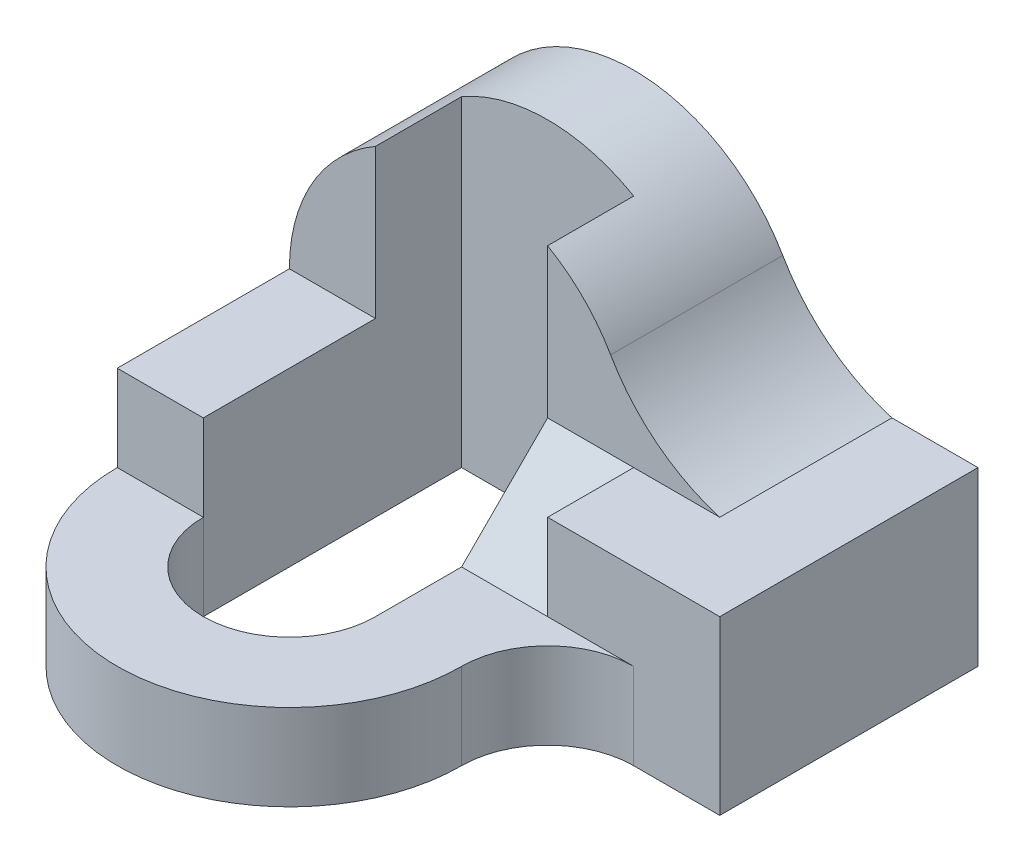
ISO-10303-21;
HEADER;
FILE_DESCRIPTION(('STEP AP214'),'2;1');
FILE_NAME('part.step','',(''),(''),'','','');
FILE_SCHEMA(('AUTOMOTIVE_DESIGN { 1 0 10303 214 1 1 1 1 }'));
ENDSEC;
DATA;
#1=APPLICATION_CONTEXT('core data for automotive mechanical design processes');
#2=APPLICATION_PROTOCOL_DEFINITION('international standard','automotive_design',2000,#1);
#3=PRODUCT_CONTEXT('',#1,'mechanical');
#4=PRODUCT('Part','Part','',(#3));
#5=PRODUCT_RELATED_PRODUCT_CATEGORY('part','',(#4));
#6=PRODUCT_DEFINITION_FORMATION('','',#4);
#7=PRODUCT_DEFINITION_CONTEXT('part definition',#1,'design');
#8=PRODUCT_DEFINITION('design','',#6,#7);
#9=PRODUCT_DEFINITION_SHAPE('','',#8);
#10=(LENGTH_UNIT() NAMED_UNIT(*) SI_UNIT(.MILLI.,.METRE.));
#11=(NAMED_UNIT(*) PLANE_ANGLE_UNIT() SI_UNIT($,.RADIAN.));
#12=(NAMED_UNIT(*) SI_UNIT($,.STERADIAN.) SOLID_ANGLE_UNIT());
#13=UNCERTAINTY_MEASURE_WITH_UNIT(LENGTH_MEASURE(1.E-05),#10,'distance_accuracy_value','');
#14=(GEOMETRIC_REPRESENTATION_CONTEXT(3) GLOBAL_UNCERTAINTY_ASSIGNED_CONTEXT((#13)) GLOBAL_UNIT_ASSIGNED_CONTEXT((#10,
#11,#12)) REPRESENTATION_CONTEXT('',''));
#15=CARTESIAN_POINT('',(0.,0.,0.));
#16=DIRECTION('',(0.,0.,1.));
#17=DIRECTION('',(1.,0.,0.));
#18=AXIS2_PLACEMENT_3D('',#15,#16,#17);
#19=CARTESIAN_POINT('',(3.,1.,3.));
#20=DIRECTION('',(0.,-1.,0.));
#21=DIRECTION('',(1.,0.,0.));
#22=AXIS2_PLACEMENT_3D('',#19,#20,#21);
#23=PLANE('',#22);
#24=DIRECTION('',(0.,0.,-1.));
#25=VECTOR('',#24,1.);
#26=CARTESIAN_POINT('',(1.,1.,3.));
#27=LINE('',#26,#25);
#28=CARTESIAN_POINT('',(1.,1.,3.));
#29=VERTEX_POINT('',#28);
#30=CARTESIAN_POINT('',(1.,1.,2.));
#31=VERTEX_POINT('',#30);
#32=EDGE_CURVE('E203',#29,#31,#27,.T.);
#33=ORIENTED_EDGE('',*,*,#32,.F.);
#34=DIRECTION('',(-1.,0.,0.));
#35=VECTOR('',#34,1.);
#36=CARTESIAN_POINT('',(3.,1.,3.));
#37=LINE('',#36,#35);
#38=CARTESIAN_POINT('',(3.,1.,3.));
#39=VERTEX_POINT('',#38);
#40=EDGE_CURVE('E268',#39,#29,#37,.T.);
#41=ORIENTED_EDGE('',*,*,#40,.F.);
#42=DIRECTION('',(0.,0.,-1.));
#43=VECTOR('',#42,1.);
#44=CARTESIAN_POINT('',(3.,1.,3.));
#45=LINE('',#44,#43);
#46=CARTESIAN_POINT('',(3.,1.,0.));
#47=VERTEX_POINT('',#46);
#48=EDGE_CURVE('E280',#39,#47,#45,.T.);
#49=ORIENTED_EDGE('',*,*,#48,.T.);
#50=DIRECTION('',(-1.,0.,0.));
#51=VECTOR('',#50,1.);
#52=CARTESIAN_POINT('',(3.,1.,0.));
#53=LINE('',#52,#51);
#54=CARTESIAN_POINT('',(2.,1.,0.));
#55=VERTEX_POINT('',#54);
#56=EDGE_CURVE('E266',#47,#55,#53,.T.);
#57=ORIENTED_EDGE('',*,*,#56,.T.);
#58=DIRECTION('',(0.,0.,-1.));
#59=VECTOR('',#58,1.);
#60=CARTESIAN_POINT('',(2.,1.,2.));
#61=LINE('',#60,#59);
#62=CARTESIAN_POINT('',(2.,1.,2.));
#63=VERTEX_POINT('',#62);
#64=EDGE_CURVE('E259',#63,#55,#61,.T.);
#65=ORIENTED_EDGE('',*,*,#64,.F.);
#66=DIRECTION('',(-1.,0.,0.));
#67=VECTOR('',#66,1.);
#68=CARTESIAN_POINT('',(2.,1.,2.));
#69=LINE('',#68,#67);
#70=EDGE_CURVE('E246',#63,#31,#69,.T.);
#71=ORIENTED_EDGE('',*,*,#70,.T.);
#72=EDGE_LOOP('',(#33,#41,#49,#57,#65,#71));
#73=FACE_BOUND('',#72,.T.);
#74=ADVANCED_FACE('F33',(#73),#23,.F.);
#75=CARTESIAN_POINT('',(0.,0.,3.));
#76=DIRECTION('',(0.,0.,1.));
#77=DIRECTION('',(1.,0.,0.));
#78=AXIS2_PLACEMENT_3D('',#75,#76,#77);
#79=PLANE('',#78);
#80=ORIENTED_EDGE('',*,*,#40,.T.);
#81=DIRECTION('',(0.,1.,0.));
#82=VECTOR('',#81,1.);
#83=CARTESIAN_POINT('',(1.,0.,3.));
#84=LINE('',#83,#82);
#85=CARTESIAN_POINT('',(1.,0.,3.));
#86=VERTEX_POINT('',#85);
#87=EDGE_CURVE('E209',#86,#29,#84,.T.);
#88=ORIENTED_EDGE('',*,*,#87,.F.);
#89=DIRECTION('',(-1.,0.,0.));
#90=VECTOR('',#89,1.);
#91=CARTESIAN_POINT('',(2.,0.,3.));
#92=LINE('',#91,#90);
#93=CARTESIAN_POINT('',(2.,0.,3.));
#94=VERTEX_POINT('',#93);
#95=EDGE_CURVE('E309',#94,#86,#92,.T.);
#96=ORIENTED_EDGE('',*,*,#95,.F.);
#97=DIRECTION('',(0.,1.,0.));
#98=VECTOR('',#97,1.);
#99=CARTESIAN_POINT('',(2.,-0.999999999999999,3.));
#100=LINE('',#99,#98);
#101=CARTESIAN_POINT('',(2.,-0.999999999999999,3.));
#102=VERTEX_POINT('',#101);
#103=EDGE_CURVE('E194',#102,#94,#100,.T.);
#104=ORIENTED_EDGE('',*,*,#103,.F.);
#105=DIRECTION('',(1.,0.,0.));
#106=VECTOR('',#105,1.);
#107=CARTESIAN_POINT('',(3.,-0.999999999999999,3.));
#108=LINE('',#107,#106);
#109=CARTESIAN_POINT('',(3.,-0.999999999999999,3.));
#110=VERTEX_POINT('',#109);
#111=EDGE_CURVE('E263',#102,#110,#108,.T.);
#112=ORIENTED_EDGE('',*,*,#111,.T.);
#113=DIRECTION('',(0.,1.,0.));
#114=VECTOR('',#113,1.);
#115=CARTESIAN_POINT('',(3.,-0.999999999999999,3.));
#116=LINE('',#115,#114);
#117=EDGE_CURVE('E265',#110,#39,#116,.T.);
#118=ORIENTED_EDGE('',*,*,#117,.T.);
#119=EDGE_LOOP('',(#80,#88,#96,#104,#112,#118));
#120=FACE_BOUND('',#119,.T.);
#121=ADVANCED_FACE('F337',(#120),#79,.T.);
#122=CARTESIAN_POINT('',(-1.,1.,2.));
#123=DIRECTION('',(0.,0.,-1.));
#124=DIRECTION('',(-1.,0.,0.));
#125=AXIS2_PLACEMENT_3D('',#122,#123,#124);
#126=PLANE('',#125);
#127=CARTESIAN_POINT('',(-2.,1.,2.));
#128=VERTEX_POINT('',#127);
#129=CARTESIAN_POINT('',(-3.,1.,2.));
#130=VERTEX_POINT('',#129);
#131=EDGE_CURVE('E245',#128,#130,#69,.T.);
#132=ORIENTED_EDGE('',*,*,#131,.F.);
#133=DIRECTION('',(0.,1.,0.));
#134=VECTOR('',#133,1.);
#135=CARTESIAN_POINT('',(-2.,1.,2.));
#136=LINE('',#135,#134);
#137=CARTESIAN_POINT('',(-2.,2.73205080756888,2.));
#138=VERTEX_POINT('',#137);
#139=EDGE_CURVE('E11',#128,#138,#136,.T.);
#140=ORIENTED_EDGE('',*,*,#139,.T.);
#141=CARTESIAN_POINT('',(-1.,1.,2.));
#142=DIRECTION('',(0.,0.,-1.));
#143=DIRECTION('',(-1.,0.,0.));
#144=AXIS2_PLACEMENT_3D('',#141,#142,#143);
#145=CIRCLE('',#144,2.);
#146=EDGE_CURVE('E238',#130,#138,#145,.T.);
#147=ORIENTED_EDGE('',*,*,#146,.F.);
#148=EDGE_LOOP('',(#132,#140,#147));
#149=FACE_BOUND('',#148,.T.);
#150=ADVANCED_FACE('F335',(#149),#126,.F.);
#151=CARTESIAN_POINT('',(-3.,-1.,3.));
#152=DIRECTION('',(1.,0.,0.));
#153=DIRECTION('',(0.,0.,-1.));
#154=AXIS2_PLACEMENT_3D('',#151,#152,#153);
#155=PLANE('',#154);
#156=DIRECTION('',(0.,-1.,0.));
#157=VECTOR('',#156,1.);
#158=CARTESIAN_POINT('',(-3.,-1.,0.));
#159=LINE('',#158,#157);
#160=CARTESIAN_POINT('',(-3.,1.,0.));
#161=VERTEX_POINT('',#160);
#162=CARTESIAN_POINT('',(-3.,-1.,0.));
#163=VERTEX_POINT('',#162);
#164=EDGE_CURVE('E258',#161,#163,#159,.T.);
#165=ORIENTED_EDGE('',*,*,#164,.T.);
#166=DIRECTION('',(0.,0.,-1.));
#167=VECTOR('',#166,1.);
#168=CARTESIAN_POINT('',(-3.,-1.,3.));
#169=LINE('',#168,#167);
#170=CARTESIAN_POINT('',(-3.,-1.,4.));
#171=VERTEX_POINT('',#170);
#172=EDGE_CURVE('E286',#171,#163,#169,.T.);
#173=ORIENTED_EDGE('',*,*,#172,.F.);
#174=DIRECTION('',(0.,1.,0.));
#175=VECTOR('',#174,1.);
#176=CARTESIAN_POINT('',(-3.,-1.,4.));
#177=LINE('',#176,#175);
#178=CARTESIAN_POINT('',(-3.,0.,4.00000000000001));
#179=VERTEX_POINT('',#178);
#180=EDGE_CURVE('E188',#171,#179,#177,.T.);
#181=ORIENTED_EDGE('',*,*,#180,.T.);
#182=DIRECTION('',(0.,1.,0.));
#183=VECTOR('',#182,1.);
#184=CARTESIAN_POINT('',(-3.,0.,4.00000000000001));
#185=LINE('',#184,#183);
#186=CARTESIAN_POINT('',(-3.,1.,4.00000000000001));
#187=VERTEX_POINT('',#186);
#188=EDGE_CURVE('E163',#179,#187,#185,.T.);
#189=ORIENTED_EDGE('',*,*,#188,.T.);
#190=DIRECTION('',(0.,0.,-1.));
#191=VECTOR('',#190,1.);
#192=CARTESIAN_POINT('',(-3.,1.,3.));
#193=LINE('',#192,#191);
#194=EDGE_CURVE('E270',#187,#130,#193,.T.);
#195=ORIENTED_EDGE('',*,*,#194,.T.);
#196=DIRECTION('',(0.,0.,-1.));
#197=VECTOR('',#196,1.);
#198=CARTESIAN_POINT('',(-3.,1.,2.));
#199=LINE('',#198,#197);
#200=EDGE_CURVE('E255',#130,#161,#199,.T.);
#201=ORIENTED_EDGE('',*,*,#200,.T.);
#202=EDGE_LOOP('',(#165,#173,#181,#189,#195,#201));
#203=FACE_BOUND('',#202,.T.);
#204=ADVANCED_FACE('F35',(#203),#155,.F.);
#205=CARTESIAN_POINT('',(3.,-0.999999999999999,3.));
#206=DIRECTION('',(0.,1.,0.));
#207=DIRECTION('',(-1.,0.,0.));
#208=AXIS2_PLACEMENT_3D('',#205,#206,#207);
#209=PLANE('',#208);
#210=DIRECTION('',(0.,0.,1.));
#211=VECTOR('',#210,1.);
#212=CARTESIAN_POINT('',(-2.,-1.,1.));
#213=LINE('',#212,#211);
#214=CARTESIAN_POINT('',(-2.,-1.,1.));
#215=VERTEX_POINT('',#214);
#216=CARTESIAN_POINT('',(-2.,-1.,4.));
#217=VERTEX_POINT('',#216);
#218=EDGE_CURVE('E228',#215,#217,#213,.T.);
#219=ORIENTED_EDGE('',*,*,#218,.T.);
#220=CARTESIAN_POINT('',(-1.,-1.,4.));
#221=DIRECTION('',(0.,1.,0.));
#222=DIRECTION('',(-1.,0.,0.));
#223=AXIS2_PLACEMENT_3D('',#220,#221,#222);
#224=CIRCLE('',#223,1.);
#225=CARTESIAN_POINT('',(0.,-1.,4.));
#226=VERTEX_POINT('',#225);
#227=EDGE_CURVE('E187',#226,#217,#224,.F.);
#228=ORIENTED_EDGE('',*,*,#227,.F.);
#229=DIRECTION('',(0.,0.,1.));
#230=VECTOR('',#229,1.);
#231=CARTESIAN_POINT('',(0.,-1.,1.));
#232=LINE('',#231,#230);
#233=CARTESIAN_POINT('',(0.,-1.,1.));
#234=VERTEX_POINT('',#233);
#235=EDGE_CURVE('E227',#234,#226,#232,.T.);
#236=ORIENTED_EDGE('',*,*,#235,.F.);
#237=DIRECTION('',(1.,0.,0.));
#238=VECTOR('',#237,1.);
#239=CARTESIAN_POINT('',(0.,-1.,1.));
#240=LINE('',#239,#238);
#241=EDGE_CURVE('E215',#215,#234,#240,.T.);
#242=ORIENTED_EDGE('',*,*,#241,.F.);
#243=EDGE_LOOP('',(#219,#228,#236,#242));
#244=FACE_BOUND('',#243,.T.);
#245=CARTESIAN_POINT('',(-1.,-1.,4.));
#246=DIRECTION('',(0.,1.,0.));
#247=DIRECTION('',(-1.,0.,0.));
#248=AXIS2_PLACEMENT_3D('',#245,#246,#247);
#249=CIRCLE('',#248,2.);
#250=CARTESIAN_POINT('',(1.,-1.,4.));
#251=VERTEX_POINT('',#250);
#252=EDGE_CURVE('E371',#171,#251,#249,.T.);
#253=ORIENTED_EDGE('',*,*,#252,.F.);
#254=ORIENTED_EDGE('',*,*,#172,.T.);
#255=DIRECTION('',(1.,0.,0.));
#256=VECTOR('',#255,1.);
#257=CARTESIAN_POINT('',(3.,-0.999999999999999,0.));
#258=LINE('',#257,#256);
#259=CARTESIAN_POINT('',(3.,-0.999999999999999,0.));
#260=VERTEX_POINT('',#259);
#261=EDGE_CURVE('E273',#163,#260,#258,.T.);
#262=ORIENTED_EDGE('',*,*,#261,.T.);
#263=DIRECTION('',(0.,0.,-1.));
#264=VECTOR('',#263,1.);
#265=CARTESIAN_POINT('',(3.,-0.999999999999999,3.));
#266=LINE('',#265,#264);
#267=EDGE_CURVE('E283',#110,#260,#266,.T.);
#268=ORIENTED_EDGE('',*,*,#267,.F.);
#269=ORIENTED_EDGE('',*,*,#111,.F.);
#270=CARTESIAN_POINT('',(2.,-0.999999999999999,4.));
#271=DIRECTION('',(0.,1.,0.));
#272=DIRECTION('',(-1.,0.,0.));
#273=AXIS2_PLACEMENT_3D('',#270,#271,#272);
#274=CIRCLE('',#273,1.);
#275=EDGE_CURVE('E383',#251,#102,#274,.F.);
#276=ORIENTED_EDGE('',*,*,#275,.F.);
#277=EDGE_LOOP('',(#253,#254,#262,#268,#269,#276));
#278=FACE_BOUND('',#277,.T.);
#279=ADVANCED_FACE('F306',(#244,#278),#209,.F.);
#280=CARTESIAN_POINT('',(3.,-0.999999999999999,3.));
#281=DIRECTION('',(-1.,0.,0.));
#282=DIRECTION('',(0.,0.,1.));
#283=AXIS2_PLACEMENT_3D('',#280,#281,#282);
#284=PLANE('',#283);
#285=DIRECTION('',(0.,1.,0.));
#286=VECTOR('',#285,1.);
#287=CARTESIAN_POINT('',(3.,-0.999999999999999,0.));
#288=LINE('',#287,#286);
#289=EDGE_CURVE('E275',#260,#47,#288,.T.);
#290=ORIENTED_EDGE('',*,*,#289,.T.);
#291=ORIENTED_EDGE('',*,*,#48,.F.);
#292=ORIENTED_EDGE('',*,*,#117,.F.);
#293=ORIENTED_EDGE('',*,*,#267,.T.);
#294=EDGE_LOOP('',(#290,#291,#292,#293));
#295=FACE_BOUND('',#294,.T.);
#296=ADVANCED_FACE('F355',(#295),#284,.F.);
#297=ORIENTED_EDGE('',*,*,#194,.F.);
#298=DIRECTION('',(-1.,0.,0.));
#299=VECTOR('',#298,1.);
#300=CARTESIAN_POINT('',(-2.,1.,4.));
#301=LINE('',#300,#299);
#302=CARTESIAN_POINT('',(-2.,1.,4.));
#303=VERTEX_POINT('',#302);
#304=EDGE_CURVE('E174',#303,#187,#301,.T.);
#305=ORIENTED_EDGE('',*,*,#304,.F.);
#306=DIRECTION('',(0.,0.,-1.));
#307=VECTOR('',#306,1.);
#308=CARTESIAN_POINT('',(-2.,1.,3.));
#309=LINE('',#308,#307);
#310=EDGE_CURVE('E183',#303,#128,#309,.T.);
#311=ORIENTED_EDGE('',*,*,#310,.T.);
#312=ORIENTED_EDGE('',*,*,#131,.T.);
#313=EDGE_LOOP('',(#297,#305,#311,#312));
#314=FACE_BOUND('',#313,.T.);
#315=ADVANCED_FACE('F332',(#314),#23,.F.);
#316=CARTESIAN_POINT('',(0.,0.,0.));
#317=DIRECTION('',(0.,0.,1.));
#318=DIRECTION('',(1.,0.,0.));
#319=AXIS2_PLACEMENT_3D('',#316,#317,#318);
#320=PLANE('',#319);
#321=ORIENTED_EDGE('',*,*,#164,.F.);
#322=CARTESIAN_POINT('',(-1.,1.,0.));
#323=DIRECTION('',(0.,0.,-1.));
#324=DIRECTION('',(-1.,0.,0.));
#325=AXIS2_PLACEMENT_3D('',#322,#323,#324);
#326=CIRCLE('',#325,2.);
#327=CARTESIAN_POINT('',(0.732050807568877,2.,0.));
#328=VERTEX_POINT('',#327);
#329=EDGE_CURVE('E237',#161,#328,#326,.T.);
#330=ORIENTED_EDGE('',*,*,#329,.T.);
#331=CARTESIAN_POINT('',(2.62004618869898,3.09003464152424,0.));
#332=DIRECTION('',(0.,0.,1.));
#333=DIRECTION('',(1.,0.,0.));
#334=AXIS2_PLACEMENT_3D('',#331,#332,#333);
#335=CIRCLE('',#334,2.18006928304847);
#336=EDGE_CURVE('E252',#328,#55,#335,.T.);
#337=ORIENTED_EDGE('',*,*,#336,.T.);
#338=ORIENTED_EDGE('',*,*,#56,.F.);
#339=ORIENTED_EDGE('',*,*,#289,.F.);
#340=ORIENTED_EDGE('',*,*,#261,.F.);
#341=EDGE_LOOP('',(#321,#330,#337,#338,#339,#340));
#342=FACE_BOUND('',#341,.T.);
#343=ADVANCED_FACE('F326',(#342),#320,.F.);
#344=CARTESIAN_POINT('',(-1.,1.,2.));
#345=DIRECTION('',(0.,0.,-1.));
#346=DIRECTION('',(-1.,0.,0.));
#347=AXIS2_PLACEMENT_3D('',#344,#345,#346);
#348=CYLINDRICAL_SURFACE('',#347,2.);
#349=DIRECTION('',(0.,0.,1.));
#350=VECTOR('',#349,1.);
#351=CARTESIAN_POINT('',(-2.,2.73205080756888,1.));
#352=LINE('',#351,#350);
#353=CARTESIAN_POINT('',(-2.,2.73205080756888,1.));
#354=VERTEX_POINT('',#353);
#355=EDGE_CURVE('E230',#354,#138,#352,.T.);
#356=ORIENTED_EDGE('',*,*,#355,.F.);
#357=CARTESIAN_POINT('',(-1.,1.,1.));
#358=DIRECTION('',(0.,0.,1.));
#359=DIRECTION('',(1.,0.,0.));
#360=AXIS2_PLACEMENT_3D('',#357,#358,#359);
#361=CIRCLE('',#360,2.);
#362=CARTESIAN_POINT('',(0.,2.73205080756888,1.));
#363=VERTEX_POINT('',#362);
#364=EDGE_CURVE('E222',#363,#354,#361,.T.);
#365=ORIENTED_EDGE('',*,*,#364,.F.);
#366=DIRECTION('',(0.,0.,1.));
#367=VECTOR('',#366,1.);
#368=CARTESIAN_POINT('',(0.,2.73205080756888,1.));
#369=LINE('',#368,#367);
#370=CARTESIAN_POINT('',(0.,2.73205080756888,2.));
#371=VERTEX_POINT('',#370);
#372=EDGE_CURVE('E232',#363,#371,#369,.T.);
#373=ORIENTED_EDGE('',*,*,#372,.T.);
#374=CARTESIAN_POINT('',(0.732050807568877,2.,2.));
#375=VERTEX_POINT('',#374);
#376=EDGE_CURVE('E242',#371,#375,#145,.T.);
#377=ORIENTED_EDGE('',*,*,#376,.T.);
#378=DIRECTION('',(0.,0.,-1.));
#379=VECTOR('',#378,1.);
#380=CARTESIAN_POINT('',(0.732050807568877,2.,2.));
#381=LINE('',#380,#379);
#382=EDGE_CURVE('E249',#375,#328,#381,.T.);
#383=ORIENTED_EDGE('',*,*,#382,.T.);
#384=ORIENTED_EDGE('',*,*,#329,.F.);
#385=ORIENTED_EDGE('',*,*,#200,.F.);
#386=ORIENTED_EDGE('',*,*,#146,.T.);
#387=EDGE_LOOP('',(#356,#365,#373,#377,#383,#384,#385,#386));
#388=FACE_BOUND('',#387,.T.);
#389=ADVANCED_FACE('F299',(#388),#348,.T.);
#390=CARTESIAN_POINT('',(2.62004618869898,3.09003464152424,2.));
#391=DIRECTION('',(0.,0.,-1.));
#392=DIRECTION('',(-1.,0.,0.));
#393=AXIS2_PLACEMENT_3D('',#390,#391,#392);
#394=CYLINDRICAL_SURFACE('',#393,2.18006928304847);
#395=ORIENTED_EDGE('',*,*,#336,.F.);
#396=ORIENTED_EDGE('',*,*,#382,.F.);
#397=CARTESIAN_POINT('',(2.62004618869898,3.09003464152424,2.));
#398=DIRECTION('',(0.,0.,1.));
#399=DIRECTION('',(1.,0.,0.));
#400=AXIS2_PLACEMENT_3D('',#397,#398,#399);
#401=CIRCLE('',#400,2.18006928304847);
#402=EDGE_CURVE('E241',#375,#63,#401,.T.);
#403=ORIENTED_EDGE('',*,*,#402,.T.);
#404=ORIENTED_EDGE('',*,*,#64,.T.);
#405=EDGE_LOOP('',(#395,#396,#403,#404));
#406=FACE_BOUND('',#405,.T.);
#407=ADVANCED_FACE('F321',(#406),#394,.F.);
#408=ORIENTED_EDGE('',*,*,#376,.F.);
#409=DIRECTION('',(0.,-1.,0.));
#410=VECTOR('',#409,1.);
#411=CARTESIAN_POINT('',(0.,1.,2.));
#412=LINE('',#411,#410);
#413=CARTESIAN_POINT('',(0.,1.,2.));
#414=VERTEX_POINT('',#413);
#415=EDGE_CURVE('E41',#371,#414,#412,.T.);
#416=ORIENTED_EDGE('',*,*,#415,.T.);
#417=DIRECTION('',(-1.,0.,0.));
#418=VECTOR('',#417,1.);
#419=CARTESIAN_POINT('',(1.,1.,2.));
#420=LINE('',#419,#418);
#421=EDGE_CURVE('E56',#31,#414,#420,.T.);
#422=ORIENTED_EDGE('',*,*,#421,.F.);
#423=ORIENTED_EDGE('',*,*,#70,.F.);
#424=ORIENTED_EDGE('',*,*,#402,.F.);
#425=EDGE_LOOP('',(#408,#416,#422,#423,#424));
#426=FACE_BOUND('',#425,.T.);
#427=ADVANCED_FACE('F291',(#426),#126,.F.);
#428=CARTESIAN_POINT('',(-2.,-1.,1.));
#429=DIRECTION('',(-1.,0.,0.));
#430=DIRECTION('',(0.,0.,1.));
#431=AXIS2_PLACEMENT_3D('',#428,#429,#430);
#432=PLANE('',#431);
#433=ORIENTED_EDGE('',*,*,#310,.F.);
#434=DIRECTION('',(0.,1.,0.));
#435=VECTOR('',#434,1.);
#436=CARTESIAN_POINT('',(-2.,0.,4.));
#437=LINE('',#436,#435);
#438=CARTESIAN_POINT('',(-2.,0.,4.));
#439=VERTEX_POINT('',#438);
#440=EDGE_CURVE('E160',#439,#303,#437,.T.);
#441=ORIENTED_EDGE('',*,*,#440,.F.);
#442=DIRECTION('',(0.,1.,0.));
#443=VECTOR('',#442,1.);
#444=CARTESIAN_POINT('',(-2.,-1.,4.));
#445=LINE('',#444,#443);
#446=EDGE_CURVE('E180',#217,#439,#445,.T.);
#447=ORIENTED_EDGE('',*,*,#446,.F.);
#448=ORIENTED_EDGE('',*,*,#218,.F.);
#449=DIRECTION('',(0.,-1.,0.));
#450=VECTOR('',#449,1.);
#451=CARTESIAN_POINT('',(-2.,-1.,1.));
#452=LINE('',#451,#450);
#453=EDGE_CURVE('E224',#354,#215,#452,.T.);
#454=ORIENTED_EDGE('',*,*,#453,.F.);
#455=ORIENTED_EDGE('',*,*,#355,.T.);
#456=ORIENTED_EDGE('',*,*,#139,.F.);
#457=EDGE_LOOP('',(#433,#441,#447,#448,#454,#455,#456));
#458=FACE_BOUND('',#457,.T.);
#459=ADVANCED_FACE('F179',(#458),#432,.F.);
#460=CARTESIAN_POINT('',(0.,-1.,1.));
#461=DIRECTION('',(1.,0.,0.));
#462=DIRECTION('',(0.,0.,-1.));
#463=AXIS2_PLACEMENT_3D('',#460,#461,#462);
#464=PLANE('',#463);
#465=DIRECTION('',(0.,1.,0.));
#466=VECTOR('',#465,1.);
#467=CARTESIAN_POINT('',(0.,-1.,4.));
#468=LINE('',#467,#466);
#469=CARTESIAN_POINT('',(0.,0.,4.));
#470=VERTEX_POINT('',#469);
#471=EDGE_CURVE('E189',#226,#470,#468,.T.);
#472=ORIENTED_EDGE('',*,*,#471,.T.);
#473=DIRECTION('',(0.,0.,1.));
#474=VECTOR('',#473,1.);
#475=CARTESIAN_POINT('',(0.,0.,3.));
#476=LINE('',#475,#474);
#477=CARTESIAN_POINT('',(0.,0.,3.));
#478=VERTEX_POINT('',#477);
#479=EDGE_CURVE('E169',#478,#470,#476,.T.);
#480=ORIENTED_EDGE('',*,*,#479,.F.);
#481=DIRECTION('',(0.,-0.707106781186548,0.707106781186548));
#482=VECTOR('',#481,1.);
#483=CARTESIAN_POINT('',(0.,1.,2.));
#484=LINE('',#483,#482);
#485=EDGE_CURVE('E192',#414,#478,#484,.T.);
#486=ORIENTED_EDGE('',*,*,#485,.F.);
#487=ORIENTED_EDGE('',*,*,#415,.F.);
#488=ORIENTED_EDGE('',*,*,#372,.F.);
#489=DIRECTION('',(0.,1.,0.));
#490=VECTOR('',#489,1.);
#491=CARTESIAN_POINT('',(0.,-1.,1.));
#492=LINE('',#491,#490);
#493=EDGE_CURVE('E219',#234,#363,#492,.T.);
#494=ORIENTED_EDGE('',*,*,#493,.F.);
#495=ORIENTED_EDGE('',*,*,#235,.T.);
#496=EDGE_LOOP('',(#472,#480,#486,#487,#488,#494,#495));
#497=FACE_BOUND('',#496,.T.);
#498=ADVANCED_FACE('F295',(#497),#464,.F.);
#499=CARTESIAN_POINT('',(-1.,1.,1.));
#500=DIRECTION('',(0.,0.,1.));
#501=DIRECTION('',(1.,0.,0.));
#502=AXIS2_PLACEMENT_3D('',#499,#500,#501);
#503=PLANE('',#502);
#504=ORIENTED_EDGE('',*,*,#241,.T.);
#505=ORIENTED_EDGE('',*,*,#493,.T.);
#506=ORIENTED_EDGE('',*,*,#364,.T.);
#507=ORIENTED_EDGE('',*,*,#453,.T.);
#508=EDGE_LOOP('',(#504,#505,#506,#507));
#509=FACE_BOUND('',#508,.T.);
#510=ADVANCED_FACE('F303',(#509),#503,.T.);
#511=CARTESIAN_POINT('',(1.,1.,2.));
#512=DIRECTION('',(0.,-0.707106781186548,-0.707106781186547));
#513=DIRECTION('',(0.,0.707106781186547,-0.707106781186548));
#514=AXIS2_PLACEMENT_3D('',#511,#512,#513);
#515=PLANE('',#514);
#516=ORIENTED_EDGE('',*,*,#485,.T.);
#517=DIRECTION('',(-1.,0.,0.));
#518=VECTOR('',#517,1.);
#519=CARTESIAN_POINT('',(1.,0.,3.));
#520=LINE('',#519,#518);
#521=EDGE_CURVE('E213',#86,#478,#520,.T.);
#522=ORIENTED_EDGE('',*,*,#521,.F.);
#523=DIRECTION('',(0.,-0.707106781186548,0.707106781186548));
#524=VECTOR('',#523,1.);
#525=CARTESIAN_POINT('',(1.,1.,2.));
#526=LINE('',#525,#524);
#527=EDGE_CURVE('E206',#31,#86,#526,.T.);
#528=ORIENTED_EDGE('',*,*,#527,.F.);
#529=ORIENTED_EDGE('',*,*,#421,.T.);
#530=EDGE_LOOP('',(#516,#522,#528,#529));
#531=FACE_BOUND('',#530,.T.);
#532=ADVANCED_FACE('F312',(#531),#515,.F.);
#533=CARTESIAN_POINT('',(1.,0.,0.));
#534=DIRECTION('',(1.,0.,0.));
#535=DIRECTION('',(0.,0.,-1.));
#536=AXIS2_PLACEMENT_3D('',#533,#534,#535);
#537=PLANE('',#536);
#538=ORIENTED_EDGE('',*,*,#32,.T.);
#539=ORIENTED_EDGE('',*,*,#527,.T.);
#540=ORIENTED_EDGE('',*,*,#87,.T.);
#541=EDGE_LOOP('',(#538,#539,#540));
#542=FACE_BOUND('',#541,.T.);
#543=ADVANCED_FACE('F315',(#542),#537,.F.);
#544=CARTESIAN_POINT('',(-1.,-1.,4.));
#545=DIRECTION('',(0.,1.,0.));
#546=DIRECTION('',(-1.,0.,0.));
#547=AXIS2_PLACEMENT_3D('',#544,#545,#546);
#548=CYLINDRICAL_SURFACE('',#547,2.);
#549=CARTESIAN_POINT('',(-1.,0.,4.));
#550=DIRECTION('',(0.,1.,0.));
#551=DIRECTION('',(-1.,0.,0.));
#552=AXIS2_PLACEMENT_3D('',#549,#550,#551);
#553=CIRCLE('',#552,2.);
#554=CARTESIAN_POINT('',(1.,0.,4.));
#555=VERTEX_POINT('',#554);
#556=EDGE_CURVE('E48',#179,#555,#553,.T.);
#557=ORIENTED_EDGE('',*,*,#556,.F.);
#558=ORIENTED_EDGE('',*,*,#180,.F.);
#559=ORIENTED_EDGE('',*,*,#252,.T.);
#560=DIRECTION('',(0.,1.,0.));
#561=VECTOR('',#560,1.);
#562=CARTESIAN_POINT('',(1.,-1.,4.));
#563=LINE('',#562,#561);
#564=EDGE_CURVE('E200',#251,#555,#563,.T.);
#565=ORIENTED_EDGE('',*,*,#564,.T.);
#566=EDGE_LOOP('',(#557,#558,#559,#565));
#567=FACE_BOUND('',#566,.T.);
#568=ADVANCED_FACE('F374',(#567),#548,.T.);
#569=CARTESIAN_POINT('',(-1.,-1.,4.));
#570=DIRECTION('',(0.,1.,0.));
#571=DIRECTION('',(-1.,0.,0.));
#572=AXIS2_PLACEMENT_3D('',#569,#570,#571);
#573=CYLINDRICAL_SURFACE('',#572,1.);
#574=CARTESIAN_POINT('',(-1.,0.,4.));
#575=DIRECTION('',(0.,-1.,0.));
#576=DIRECTION('',(1.,0.,0.));
#577=AXIS2_PLACEMENT_3D('',#574,#575,#576);
#578=CIRCLE('',#577,1.);
#579=EDGE_CURVE('E164',#470,#439,#578,.T.);
#580=ORIENTED_EDGE('',*,*,#579,.F.);
#581=ORIENTED_EDGE('',*,*,#471,.F.);
#582=ORIENTED_EDGE('',*,*,#227,.T.);
#583=ORIENTED_EDGE('',*,*,#446,.T.);
#584=EDGE_LOOP('',(#580,#581,#582,#583));
#585=FACE_BOUND('',#584,.T.);
#586=ADVANCED_FACE('F185',(#585),#573,.F.);
#587=CARTESIAN_POINT('',(2.,-0.999999999999999,4.));
#588=DIRECTION('',(0.,1.,0.));
#589=DIRECTION('',(-1.,0.,0.));
#590=AXIS2_PLACEMENT_3D('',#587,#588,#589);
#591=CYLINDRICAL_SURFACE('',#590,1.);
#592=CARTESIAN_POINT('',(2.,0.,4.));
#593=DIRECTION('',(0.,-1.,0.));
#594=DIRECTION('',(1.,0.,0.));
#595=AXIS2_PLACEMENT_3D('',#592,#593,#594);
#596=CIRCLE('',#595,1.);
#597=EDGE_CURVE('E375',#555,#94,#596,.T.);
#598=ORIENTED_EDGE('',*,*,#597,.F.);
#599=ORIENTED_EDGE('',*,*,#564,.F.);
#600=ORIENTED_EDGE('',*,*,#275,.T.);
#601=ORIENTED_EDGE('',*,*,#103,.T.);
#602=EDGE_LOOP('',(#598,#599,#600,#601));
#603=FACE_BOUND('',#602,.T.);
#604=ADVANCED_FACE('F386',(#603),#591,.F.);
#605=CARTESIAN_POINT('',(-2.,0.,4.));
#606=DIRECTION('',(0.,0.,-1.));
#607=DIRECTION('',(-1.,0.,0.));
#608=AXIS2_PLACEMENT_3D('',#605,#606,#607);
#609=PLANE('',#608);
#610=ORIENTED_EDGE('',*,*,#304,.T.);
#611=ORIENTED_EDGE('',*,*,#188,.F.);
#612=DIRECTION('',(-1.,0.,0.));
#613=VECTOR('',#612,1.);
#614=CARTESIAN_POINT('',(-2.,0.,4.));
#615=LINE('',#614,#613);
#616=EDGE_CURVE('E156',#439,#179,#615,.T.);
#617=ORIENTED_EDGE('',*,*,#616,.F.);
#618=ORIENTED_EDGE('',*,*,#440,.T.);
#619=EDGE_LOOP('',(#610,#611,#617,#618));
#620=FACE_BOUND('',#619,.T.);
#621=ADVANCED_FACE('F158',(#620),#609,.F.);
#622=CARTESIAN_POINT('',(-1.,0.,4.));
#623=DIRECTION('',(0.,-1.,0.));
#624=DIRECTION('',(1.,0.,0.));
#625=AXIS2_PLACEMENT_3D('',#622,#623,#624);
#626=PLANE('',#625);
#627=ORIENTED_EDGE('',*,*,#579,.T.);
#628=ORIENTED_EDGE('',*,*,#616,.T.);
#629=ORIENTED_EDGE('',*,*,#556,.T.);
#630=ORIENTED_EDGE('',*,*,#597,.T.);
#631=ORIENTED_EDGE('',*,*,#95,.T.);
#632=ORIENTED_EDGE('',*,*,#521,.T.);
#633=ORIENTED_EDGE('',*,*,#479,.T.);
#634=EDGE_LOOP('',(#627,#628,#629,#630,#631,#632,#633));
#635=FACE_BOUND('',#634,.T.);
#636=ADVANCED_FACE('F167',(#635),#626,.F.);
#637=CLOSED_SHELL('',(#74,#121,#150,#204,#279,#296,#315,#343,#389,#407,#427,#459,#498,#510,#532,
#543,#568,#586,#604,#621,#636));
#638=MANIFOLD_SOLID_BREP('B2',#637);
#639=ADVANCED_BREP_SHAPE_REPRESENTATION('',(#18,#638),#14);
#640=SHAPE_DEFINITION_REPRESENTATION(#9,#639);
ENDSEC;
END-ISO-10303-21;
